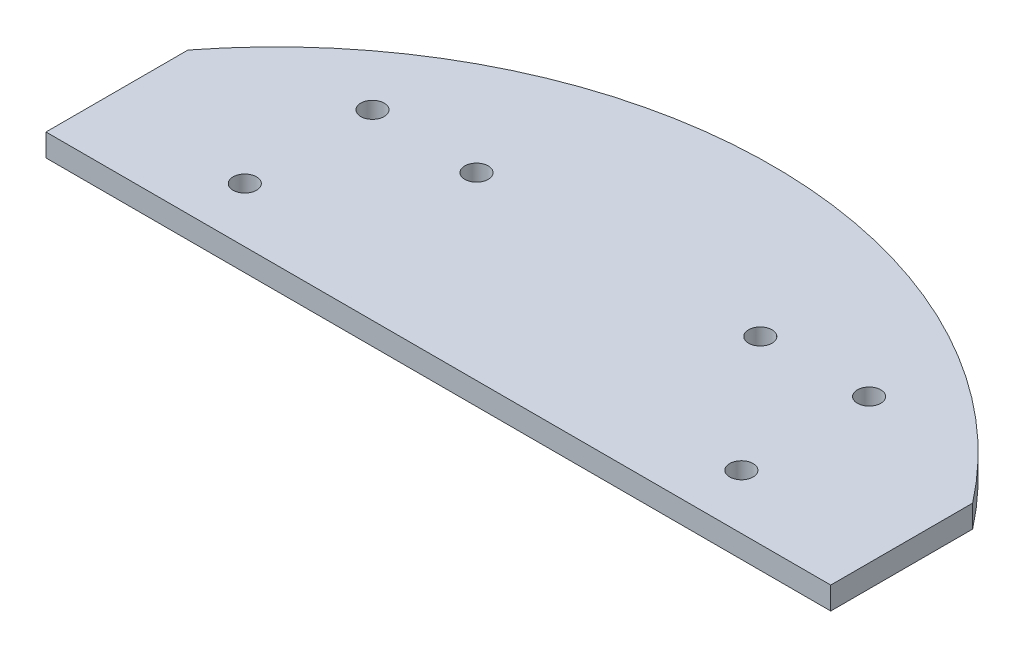
ISO-10303-21;
HEADER;
FILE_DESCRIPTION(('STEP AP214'),'2;1');
FILE_NAME('part.step','',(''),(''),'','','');
FILE_SCHEMA(('AUTOMOTIVE_DESIGN { 1 0 10303 214 1 1 1 1 }'));
ENDSEC;
DATA;
#1=APPLICATION_CONTEXT('core data for automotive mechanical design processes');
#2=APPLICATION_PROTOCOL_DEFINITION('international standard','automotive_design',2000,#1);
#3=PRODUCT_CONTEXT('',#1,'mechanical');
#4=PRODUCT('Part','Part','',(#3));
#5=PRODUCT_RELATED_PRODUCT_CATEGORY('part','',(#4));
#6=PRODUCT_DEFINITION_FORMATION('','',#4);
#7=PRODUCT_DEFINITION_CONTEXT('part definition',#1,'design');
#8=PRODUCT_DEFINITION('design','',#6,#7);
#9=PRODUCT_DEFINITION_SHAPE('','',#8);
#10=(LENGTH_UNIT() NAMED_UNIT(*) SI_UNIT(.MILLI.,.METRE.));
#11=(NAMED_UNIT(*) PLANE_ANGLE_UNIT() SI_UNIT($,.RADIAN.));
#12=(NAMED_UNIT(*) SI_UNIT($,.STERADIAN.) SOLID_ANGLE_UNIT());
#13=UNCERTAINTY_MEASURE_WITH_UNIT(LENGTH_MEASURE(1.E-05),#10,'distance_accuracy_value','');
#14=(GEOMETRIC_REPRESENTATION_CONTEXT(3) GLOBAL_UNCERTAINTY_ASSIGNED_CONTEXT((#13)) GLOBAL_UNIT_ASSIGNED_CONTEXT((#10,
#11,#12)) REPRESENTATION_CONTEXT('',''));
#15=CARTESIAN_POINT('',(0.,0.,0.));
#16=DIRECTION('',(0.,0.,1.));
#17=DIRECTION('',(1.,0.,0.));
#18=AXIS2_PLACEMENT_3D('',#15,#16,#17);
#19=CARTESIAN_POINT('',(0.,3.175,0.));
#20=DIRECTION('',(0.,1.,0.));
#21=DIRECTION('',(0.,0.,1.));
#22=AXIS2_PLACEMENT_3D('',#19,#20,#21);
#23=PLANE('',#22);
#24=CARTESIAN_POINT('',(35.,3.175,-30.6217782649107));
#25=DIRECTION('',(0.,1.,0.));
#26=DIRECTION('',(0.,0.,1.));
#27=AXIS2_PLACEMENT_3D('',#24,#25,#26);
#28=CIRCLE('',#27,1.65);
#29=CARTESIAN_POINT('',(35.,3.175,-28.9717782649107));
#30=VERTEX_POINT('',#29);
#31=EDGE_CURVE('E277',#30,#30,#28,.T.);
#32=ORIENTED_EDGE('',*,*,#31,.F.);
#33=EDGE_LOOP('',(#32));
#34=FACE_BOUND('',#33,.T.);
#35=CARTESIAN_POINT('',(20.,3.175,-48.2842712474621));
#36=DIRECTION('',(0.,1.,0.));
#37=DIRECTION('',(0.,0.,1.));
#38=AXIS2_PLACEMENT_3D('',#35,#36,#37);
#39=CIRCLE('',#38,1.65);
#40=CARTESIAN_POINT('',(20.,3.175,-46.6342712474621));
#41=VERTEX_POINT('',#40);
#42=EDGE_CURVE('E125',#41,#41,#39,.T.);
#43=ORIENTED_EDGE('',*,*,#42,.F.);
#44=EDGE_LOOP('',(#43));
#45=FACE_BOUND('',#44,.T.);
#46=CARTESIAN_POINT('',(-35.,3.175,-30.6217782649107));
#47=DIRECTION('',(0.,1.,0.));
#48=DIRECTION('',(0.,0.,-1.));
#49=AXIS2_PLACEMENT_3D('',#46,#47,#48);
#50=CIRCLE('',#49,1.65);
#51=CARTESIAN_POINT('',(-35.,3.175,-32.2717782649107));
#52=VERTEX_POINT('',#51);
#53=EDGE_CURVE('E126',#52,#52,#50,.T.);
#54=ORIENTED_EDGE('',*,*,#53,.F.);
#55=EDGE_LOOP('',(#54));
#56=FACE_BOUND('',#55,.T.);
#57=CARTESIAN_POINT('',(0.,3.175,0.));
#58=DIRECTION('',(0.,1.,0.));
#59=DIRECTION('',(0.,0.,1.));
#60=AXIS2_PLACEMENT_3D('',#57,#58,#59);
#61=CIRCLE('',#60,70.);
#62=CARTESIAN_POINT('',(55.3067347918631,3.175,-42.9087996413617));
#63=VERTEX_POINT('',#62);
#64=CARTESIAN_POINT('',(-55.3067347918631,3.175,-42.9087996413617));
#65=VERTEX_POINT('',#64);
#66=EDGE_CURVE('E88',#63,#65,#61,.T.);
#67=ORIENTED_EDGE('',*,*,#66,.T.);
#68=DIRECTION('',(0.,0.,1.));
#69=VECTOR('',#68,1.);
#70=CARTESIAN_POINT('',(-55.3067347918631,3.175,-42.9087996413617));
#71=LINE('',#70,#69);
#72=CARTESIAN_POINT('',(-55.3067347918631,3.175,-22.9087996413617));
#73=VERTEX_POINT('',#72);
#74=EDGE_CURVE('E83',#65,#73,#71,.T.);
#75=ORIENTED_EDGE('',*,*,#74,.T.);
#76=DIRECTION('',(1.,0.,0.));
#77=VECTOR('',#76,1.);
#78=CARTESIAN_POINT('',(-55.3067347918631,3.175,-22.9087996413617));
#79=LINE('',#78,#77);
#80=CARTESIAN_POINT('',(55.3067347918631,3.175,-22.9087996413617));
#81=VERTEX_POINT('',#80);
#82=EDGE_CURVE('E86',#73,#81,#79,.T.);
#83=ORIENTED_EDGE('',*,*,#82,.T.);
#84=DIRECTION('',(0.,0.,-1.));
#85=VECTOR('',#84,1.);
#86=CARTESIAN_POINT('',(55.3067347918631,3.175,-42.9087996413617));
#87=LINE('',#86,#85);
#88=EDGE_CURVE('E53',#81,#63,#87,.T.);
#89=ORIENTED_EDGE('',*,*,#88,.T.);
#90=EDGE_LOOP('',(#67,#75,#83,#89));
#91=FACE_BOUND('',#90,.T.);
#92=CARTESIAN_POINT('',(-35.,3.175,-48.6217782649107));
#93=DIRECTION('',(0.,1.,0.));
#94=DIRECTION('',(0.,0.,-1.));
#95=AXIS2_PLACEMENT_3D('',#92,#93,#94);
#96=CIRCLE('',#95,1.65);
#97=CARTESIAN_POINT('',(-35.,3.175,-50.2717782649107));
#98=VERTEX_POINT('',#97);
#99=EDGE_CURVE('E113',#98,#98,#96,.T.);
#100=ORIENTED_EDGE('',*,*,#99,.F.);
#101=EDGE_LOOP('',(#100));
#102=FACE_BOUND('',#101,.T.);
#103=CARTESIAN_POINT('',(35.,3.175,-48.6217782649107));
#104=DIRECTION('',(0.,1.,0.));
#105=DIRECTION('',(0.,0.,1.));
#106=AXIS2_PLACEMENT_3D('',#103,#104,#105);
#107=CIRCLE('',#106,1.65);
#108=CARTESIAN_POINT('',(35.,3.175,-46.9717782649107));
#109=VERTEX_POINT('',#108);
#110=EDGE_CURVE('E284',#109,#109,#107,.T.);
#111=ORIENTED_EDGE('',*,*,#110,.F.);
#112=EDGE_LOOP('',(#111));
#113=FACE_BOUND('',#112,.T.);
#114=CARTESIAN_POINT('',(-20.,3.175,-48.2842712474621));
#115=DIRECTION('',(0.,1.,0.));
#116=DIRECTION('',(0.,0.,1.));
#117=AXIS2_PLACEMENT_3D('',#114,#115,#116);
#118=CIRCLE('',#117,1.65);
#119=CARTESIAN_POINT('',(-20.,3.175,-46.6342712474621));
#120=VERTEX_POINT('',#119);
#121=EDGE_CURVE('E267',#120,#120,#118,.T.);
#122=ORIENTED_EDGE('',*,*,#121,.F.);
#123=EDGE_LOOP('',(#122));
#124=FACE_BOUND('',#123,.T.);
#125=ADVANCED_FACE('F36',(#34,#45,#56,#91,#102,#113,#124),#23,.T.);
#126=CARTESIAN_POINT('',(0.,0.,0.));
#127=DIRECTION('',(0.,1.,0.));
#128=DIRECTION('',(0.,0.,1.));
#129=AXIS2_PLACEMENT_3D('',#126,#127,#128);
#130=PLANE('',#129);
#131=CARTESIAN_POINT('',(0.,0.,0.));
#132=DIRECTION('',(0.,1.,0.));
#133=DIRECTION('',(0.,0.,1.));
#134=AXIS2_PLACEMENT_3D('',#131,#132,#133);
#135=CIRCLE('',#134,70.);
#136=CARTESIAN_POINT('',(55.3067347918631,0.,-42.9087996413617));
#137=VERTEX_POINT('',#136);
#138=CARTESIAN_POINT('',(-55.3067347918631,0.,-42.9087996413617));
#139=VERTEX_POINT('',#138);
#140=EDGE_CURVE('E131',#137,#139,#135,.T.);
#141=ORIENTED_EDGE('',*,*,#140,.F.);
#142=DIRECTION('',(0.,0.,-1.));
#143=VECTOR('',#142,1.);
#144=CARTESIAN_POINT('',(55.3067347918631,0.,-42.9087996413617));
#145=LINE('',#144,#143);
#146=CARTESIAN_POINT('',(55.3067347918631,0.,-22.9087996413617));
#147=VERTEX_POINT('',#146);
#148=EDGE_CURVE('E76',#147,#137,#145,.T.);
#149=ORIENTED_EDGE('',*,*,#148,.F.);
#150=DIRECTION('',(1.,0.,0.));
#151=VECTOR('',#150,1.);
#152=CARTESIAN_POINT('',(-55.3067347918631,0.,-22.9087996413617));
#153=LINE('',#152,#151);
#154=CARTESIAN_POINT('',(-55.3067347918631,0.,-22.9087996413617));
#155=VERTEX_POINT('',#154);
#156=EDGE_CURVE('E70',#155,#147,#153,.T.);
#157=ORIENTED_EDGE('',*,*,#156,.F.);
#158=DIRECTION('',(0.,0.,1.));
#159=VECTOR('',#158,1.);
#160=CARTESIAN_POINT('',(-55.3067347918631,0.,-42.9087996413617));
#161=LINE('',#160,#159);
#162=EDGE_CURVE('E93',#139,#155,#161,.T.);
#163=ORIENTED_EDGE('',*,*,#162,.F.);
#164=EDGE_LOOP('',(#141,#149,#157,#163));
#165=FACE_BOUND('',#164,.T.);
#166=CARTESIAN_POINT('',(-35.,0.,-30.6217782649107));
#167=DIRECTION('',(0.,1.,0.));
#168=DIRECTION('',(0.,0.,-1.));
#169=AXIS2_PLACEMENT_3D('',#166,#167,#168);
#170=CIRCLE('',#169,1.65);
#171=CARTESIAN_POINT('',(-35.,0.,-32.2717782649107));
#172=VERTEX_POINT('',#171);
#173=EDGE_CURVE('E119',#172,#172,#170,.T.);
#174=ORIENTED_EDGE('',*,*,#173,.T.);
#175=EDGE_LOOP('',(#174));
#176=FACE_BOUND('',#175,.T.);
#177=CARTESIAN_POINT('',(-35.,0.,-48.6217782649107));
#178=DIRECTION('',(0.,1.,0.));
#179=DIRECTION('',(0.,0.,-1.));
#180=AXIS2_PLACEMENT_3D('',#177,#178,#179);
#181=CIRCLE('',#180,1.65);
#182=CARTESIAN_POINT('',(-35.,0.,-50.2717782649107));
#183=VERTEX_POINT('',#182);
#184=EDGE_CURVE('E120',#183,#183,#181,.T.);
#185=ORIENTED_EDGE('',*,*,#184,.T.);
#186=EDGE_LOOP('',(#185));
#187=FACE_BOUND('',#186,.T.);
#188=CARTESIAN_POINT('',(20.,0.,-48.2842712474621));
#189=DIRECTION('',(0.,1.,0.));
#190=DIRECTION('',(0.,0.,1.));
#191=AXIS2_PLACEMENT_3D('',#188,#189,#190);
#192=CIRCLE('',#191,1.65);
#193=CARTESIAN_POINT('',(20.,0.,-46.6342712474621));
#194=VERTEX_POINT('',#193);
#195=EDGE_CURVE('E121',#194,#194,#192,.T.);
#196=ORIENTED_EDGE('',*,*,#195,.T.);
#197=EDGE_LOOP('',(#196));
#198=FACE_BOUND('',#197,.T.);
#199=CARTESIAN_POINT('',(35.,0.,-48.6217782649107));
#200=DIRECTION('',(0.,1.,0.));
#201=DIRECTION('',(0.,0.,1.));
#202=AXIS2_PLACEMENT_3D('',#199,#200,#201);
#203=CIRCLE('',#202,1.65);
#204=CARTESIAN_POINT('',(35.,0.,-46.9717782649107));
#205=VERTEX_POINT('',#204);
#206=EDGE_CURVE('E282',#205,#205,#203,.T.);
#207=ORIENTED_EDGE('',*,*,#206,.T.);
#208=EDGE_LOOP('',(#207));
#209=FACE_BOUND('',#208,.T.);
#210=CARTESIAN_POINT('',(35.,0.,-30.6217782649107));
#211=DIRECTION('',(0.,1.,0.));
#212=DIRECTION('',(0.,0.,1.));
#213=AXIS2_PLACEMENT_3D('',#210,#211,#212);
#214=CIRCLE('',#213,1.65);
#215=CARTESIAN_POINT('',(35.,0.,-28.9717782649107));
#216=VERTEX_POINT('',#215);
#217=EDGE_CURVE('E274',#216,#216,#214,.T.);
#218=ORIENTED_EDGE('',*,*,#217,.T.);
#219=EDGE_LOOP('',(#218));
#220=FACE_BOUND('',#219,.T.);
#221=CARTESIAN_POINT('',(-20.,0.,-48.2842712474621));
#222=DIRECTION('',(0.,1.,0.));
#223=DIRECTION('',(0.,0.,1.));
#224=AXIS2_PLACEMENT_3D('',#221,#222,#223);
#225=CIRCLE('',#224,1.65);
#226=CARTESIAN_POINT('',(-20.,0.,-46.6342712474621));
#227=VERTEX_POINT('',#226);
#228=EDGE_CURVE('E270',#227,#227,#225,.T.);
#229=ORIENTED_EDGE('',*,*,#228,.T.);
#230=EDGE_LOOP('',(#229));
#231=FACE_BOUND('',#230,.T.);
#232=ADVANCED_FACE('F145',(#165,#176,#187,#198,#209,#220,#231),#130,.F.);
#233=CARTESIAN_POINT('',(0.,3.175,0.));
#234=DIRECTION('',(0.,-1.,0.));
#235=DIRECTION('',(0.,0.,-1.));
#236=AXIS2_PLACEMENT_3D('',#233,#234,#235);
#237=CYLINDRICAL_SURFACE('',#236,70.);
#238=ORIENTED_EDGE('',*,*,#140,.T.);
#239=DIRECTION('',(0.,-1.,0.));
#240=VECTOR('',#239,1.);
#241=CARTESIAN_POINT('',(-55.3067347918631,3.175,-42.9087996413617));
#242=LINE('',#241,#240);
#243=EDGE_CURVE('E12',#65,#139,#242,.T.);
#244=ORIENTED_EDGE('',*,*,#243,.F.);
#245=ORIENTED_EDGE('',*,*,#66,.F.);
#246=DIRECTION('',(0.,-1.,0.));
#247=VECTOR('',#246,1.);
#248=CARTESIAN_POINT('',(55.3067347918631,3.175,-42.9087996413617));
#249=LINE('',#248,#247);
#250=EDGE_CURVE('E99',#63,#137,#249,.T.);
#251=ORIENTED_EDGE('',*,*,#250,.T.);
#252=EDGE_LOOP('',(#238,#244,#245,#251));
#253=FACE_BOUND('',#252,.T.);
#254=ADVANCED_FACE('F38',(#253),#237,.T.);
#255=CARTESIAN_POINT('',(-55.3067347918631,3.175,-42.9087996413617));
#256=DIRECTION('',(1.,0.,0.));
#257=DIRECTION('',(0.,0.,-1.));
#258=AXIS2_PLACEMENT_3D('',#255,#256,#257);
#259=PLANE('',#258);
#260=ORIENTED_EDGE('',*,*,#162,.T.);
#261=DIRECTION('',(0.,-1.,0.));
#262=VECTOR('',#261,1.);
#263=CARTESIAN_POINT('',(-55.3067347918631,3.175,-22.9087996413617));
#264=LINE('',#263,#262);
#265=EDGE_CURVE('E45',#73,#155,#264,.T.);
#266=ORIENTED_EDGE('',*,*,#265,.F.);
#267=ORIENTED_EDGE('',*,*,#74,.F.);
#268=ORIENTED_EDGE('',*,*,#243,.T.);
#269=EDGE_LOOP('',(#260,#266,#267,#268));
#270=FACE_BOUND('',#269,.T.);
#271=ADVANCED_FACE('F92',(#270),#259,.F.);
#272=CARTESIAN_POINT('',(-55.3067347918631,3.175,-22.9087996413617));
#273=DIRECTION('',(0.,0.,-1.));
#274=DIRECTION('',(-1.,0.,0.));
#275=AXIS2_PLACEMENT_3D('',#272,#273,#274);
#276=PLANE('',#275);
#277=ORIENTED_EDGE('',*,*,#156,.T.);
#278=DIRECTION('',(0.,-1.,0.));
#279=VECTOR('',#278,1.);
#280=CARTESIAN_POINT('',(55.3067347918631,3.175,-22.9087996413617));
#281=LINE('',#280,#279);
#282=EDGE_CURVE('E94',#81,#147,#281,.T.);
#283=ORIENTED_EDGE('',*,*,#282,.F.);
#284=ORIENTED_EDGE('',*,*,#82,.F.);
#285=ORIENTED_EDGE('',*,*,#265,.T.);
#286=EDGE_LOOP('',(#277,#283,#284,#285));
#287=FACE_BOUND('',#286,.T.);
#288=ADVANCED_FACE('F95',(#287),#276,.F.);
#289=CARTESIAN_POINT('',(55.3067347918631,3.175,-42.9087996413617));
#290=DIRECTION('',(-1.,0.,0.));
#291=DIRECTION('',(0.,0.,1.));
#292=AXIS2_PLACEMENT_3D('',#289,#290,#291);
#293=PLANE('',#292);
#294=ORIENTED_EDGE('',*,*,#148,.T.);
#295=ORIENTED_EDGE('',*,*,#250,.F.);
#296=ORIENTED_EDGE('',*,*,#88,.F.);
#297=ORIENTED_EDGE('',*,*,#282,.T.);
#298=EDGE_LOOP('',(#294,#295,#296,#297));
#299=FACE_BOUND('',#298,.T.);
#300=ADVANCED_FACE('F142',(#299),#293,.F.);
#301=CARTESIAN_POINT('',(-35.,3.175,-30.6217782649107));
#302=DIRECTION('',(0.,-1.,0.));
#303=DIRECTION('',(0.,0.,-1.));
#304=AXIS2_PLACEMENT_3D('',#301,#302,#303);
#305=CYLINDRICAL_SURFACE('',#304,1.65);
#306=ORIENTED_EDGE('',*,*,#53,.T.);
#307=EDGE_LOOP('',(#306));
#308=FACE_BOUND('',#307,.T.);
#309=ORIENTED_EDGE('',*,*,#173,.F.);
#310=EDGE_LOOP('',(#309));
#311=FACE_BOUND('',#310,.T.);
#312=ADVANCED_FACE('F163',(#308,#311),#305,.F.);
#313=CARTESIAN_POINT('',(-35.,3.175,-48.6217782649107));
#314=DIRECTION('',(0.,-1.,0.));
#315=DIRECTION('',(0.,0.,-1.));
#316=AXIS2_PLACEMENT_3D('',#313,#314,#315);
#317=CYLINDRICAL_SURFACE('',#316,1.65);
#318=ORIENTED_EDGE('',*,*,#99,.T.);
#319=EDGE_LOOP('',(#318));
#320=FACE_BOUND('',#319,.T.);
#321=ORIENTED_EDGE('',*,*,#184,.F.);
#322=EDGE_LOOP('',(#321));
#323=FACE_BOUND('',#322,.T.);
#324=ADVANCED_FACE('F183',(#320,#323),#317,.F.);
#325=CARTESIAN_POINT('',(20.,3.175,-48.2842712474621));
#326=DIRECTION('',(0.,-1.,0.));
#327=DIRECTION('',(0.,0.,-1.));
#328=AXIS2_PLACEMENT_3D('',#325,#326,#327);
#329=CYLINDRICAL_SURFACE('',#328,1.65);
#330=ORIENTED_EDGE('',*,*,#42,.T.);
#331=EDGE_LOOP('',(#330));
#332=FACE_BOUND('',#331,.T.);
#333=ORIENTED_EDGE('',*,*,#195,.F.);
#334=EDGE_LOOP('',(#333));
#335=FACE_BOUND('',#334,.T.);
#336=ADVANCED_FACE('F190',(#332,#335),#329,.F.);
#337=CARTESIAN_POINT('',(35.,3.175,-48.6217782649107));
#338=DIRECTION('',(0.,-1.,0.));
#339=DIRECTION('',(0.,0.,-1.));
#340=AXIS2_PLACEMENT_3D('',#337,#338,#339);
#341=CYLINDRICAL_SURFACE('',#340,1.65);
#342=ORIENTED_EDGE('',*,*,#110,.T.);
#343=EDGE_LOOP('',(#342));
#344=FACE_BOUND('',#343,.T.);
#345=ORIENTED_EDGE('',*,*,#206,.F.);
#346=EDGE_LOOP('',(#345));
#347=FACE_BOUND('',#346,.T.);
#348=ADVANCED_FACE('F197',(#344,#347),#341,.F.);
#349=CARTESIAN_POINT('',(35.,3.175,-30.6217782649107));
#350=DIRECTION('',(0.,-1.,0.));
#351=DIRECTION('',(0.,0.,-1.));
#352=AXIS2_PLACEMENT_3D('',#349,#350,#351);
#353=CYLINDRICAL_SURFACE('',#352,1.65);
#354=ORIENTED_EDGE('',*,*,#31,.T.);
#355=EDGE_LOOP('',(#354));
#356=FACE_BOUND('',#355,.T.);
#357=ORIENTED_EDGE('',*,*,#217,.F.);
#358=EDGE_LOOP('',(#357));
#359=FACE_BOUND('',#358,.T.);
#360=ADVANCED_FACE('F205',(#356,#359),#353,.F.);
#361=CARTESIAN_POINT('',(-20.,3.175,-48.2842712474621));
#362=DIRECTION('',(0.,-1.,0.));
#363=DIRECTION('',(0.,0.,-1.));
#364=AXIS2_PLACEMENT_3D('',#361,#362,#363);
#365=CYLINDRICAL_SURFACE('',#364,1.65);
#366=ORIENTED_EDGE('',*,*,#121,.T.);
#367=EDGE_LOOP('',(#366));
#368=FACE_BOUND('',#367,.T.);
#369=ORIENTED_EDGE('',*,*,#228,.F.);
#370=EDGE_LOOP('',(#369));
#371=FACE_BOUND('',#370,.T.);
#372=ADVANCED_FACE('F213',(#368,#371),#365,.F.);
#373=CLOSED_SHELL('',(#125,#232,#254,#271,#288,#300,#312,#324,#336,#348,#360,#372));
#374=MANIFOLD_SOLID_BREP('B2',#373);
#375=ADVANCED_BREP_SHAPE_REPRESENTATION('',(#18,#374),#14);
#376=SHAPE_DEFINITION_REPRESENTATION(#9,#375);
ENDSEC;
END-ISO-10303-21;
